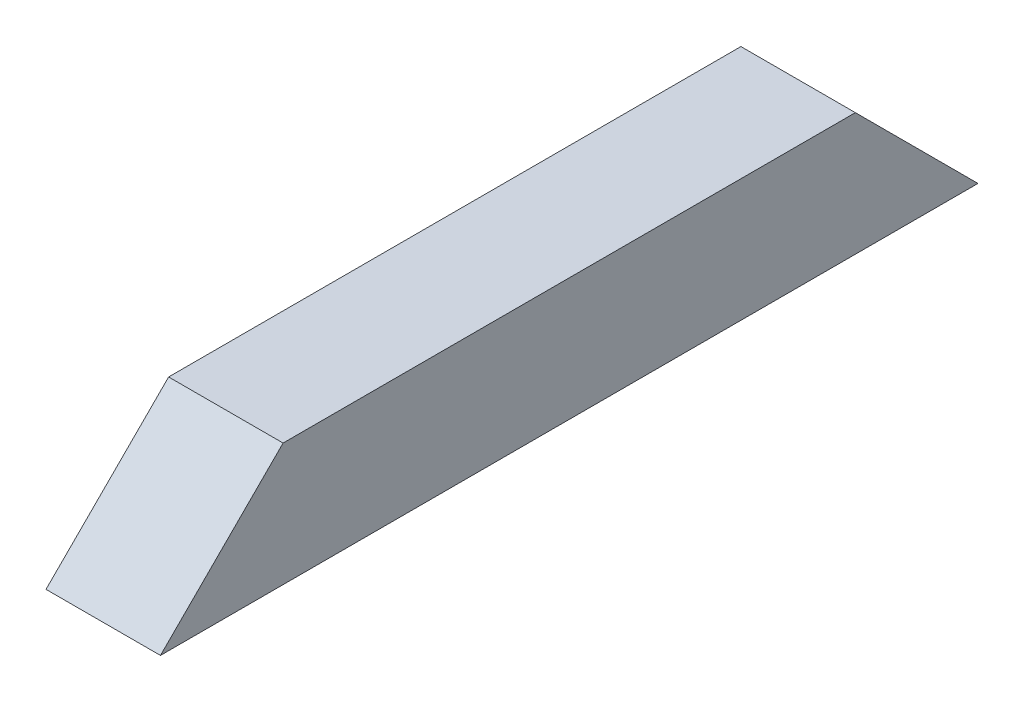
ISO-10303-21;
HEADER;
FILE_DESCRIPTION(('STEP AP214'),'2;1');
FILE_NAME('part.step','',(''),(''),'','','');
FILE_SCHEMA(('AUTOMOTIVE_DESIGN { 1 0 10303 214 1 1 1 1 }'));
ENDSEC;
DATA;
#1=APPLICATION_CONTEXT('core data for automotive mechanical design processes');
#2=APPLICATION_PROTOCOL_DEFINITION('international standard','automotive_design',2000,#1);
#3=PRODUCT_CONTEXT('',#1,'mechanical');
#4=PRODUCT('Part','Part','',(#3));
#5=PRODUCT_RELATED_PRODUCT_CATEGORY('part','',(#4));
#6=PRODUCT_DEFINITION_FORMATION('','',#4);
#7=PRODUCT_DEFINITION_CONTEXT('part definition',#1,'design');
#8=PRODUCT_DEFINITION('design','',#6,#7);
#9=PRODUCT_DEFINITION_SHAPE('','',#8);
#10=(LENGTH_UNIT() NAMED_UNIT(*) SI_UNIT(.MILLI.,.METRE.));
#11=(NAMED_UNIT(*) PLANE_ANGLE_UNIT() SI_UNIT($,.RADIAN.));
#12=(NAMED_UNIT(*) SI_UNIT($,.STERADIAN.) SOLID_ANGLE_UNIT());
#13=UNCERTAINTY_MEASURE_WITH_UNIT(LENGTH_MEASURE(1.E-05),#10,'distance_accuracy_value','');
#14=(GEOMETRIC_REPRESENTATION_CONTEXT(3) GLOBAL_UNCERTAINTY_ASSIGNED_CONTEXT((#13)) GLOBAL_UNIT_ASSIGNED_CONTEXT((#10,
#11,#12)) REPRESENTATION_CONTEXT('',''));
#15=CARTESIAN_POINT('',(0.,0.,0.));
#16=DIRECTION('',(0.,0.,1.));
#17=DIRECTION('',(1.,0.,0.));
#18=AXIS2_PLACEMENT_3D('',#15,#16,#17);
#19=CARTESIAN_POINT('',(0.,9.525,0.));
#20=DIRECTION('',(1.,0.,0.));
#21=DIRECTION('',(0.,0.,-1.));
#22=AXIS2_PLACEMENT_3D('',#19,#20,#21);
#23=PLANE('',#22);
#24=DIRECTION('',(0.,0.,1.));
#25=VECTOR('',#24,1.);
#26=CARTESIAN_POINT('',(0.,9.525,0.));
#27=LINE('',#26,#25);
#28=CARTESIAN_POINT('',(0.,9.525,-53.975));
#29=VERTEX_POINT('',#28);
#30=CARTESIAN_POINT('',(0.,9.525,-9.52499999999997));
#31=VERTEX_POINT('',#30);
#32=EDGE_CURVE('E42',#29,#31,#27,.T.);
#33=ORIENTED_EDGE('',*,*,#32,.F.);
#34=DIRECTION('',(0.,-0.707106781186548,-0.707106781186547));
#35=VECTOR('',#34,1.);
#36=CARTESIAN_POINT('',(0.,31.75,-31.75));
#37=LINE('',#36,#35);
#38=CARTESIAN_POINT('',(0.,0.,-63.5));
#39=VERTEX_POINT('',#38);
#40=EDGE_CURVE('E75',#29,#39,#37,.T.);
#41=ORIENTED_EDGE('',*,*,#40,.T.);
#42=DIRECTION('',(0.,0.,1.));
#43=VECTOR('',#42,1.);
#44=CARTESIAN_POINT('',(0.,0.,0.));
#45=LINE('',#44,#43);
#46=CARTESIAN_POINT('',(0.,0.,0.));
#47=VERTEX_POINT('',#46);
#48=EDGE_CURVE('E97',#39,#47,#45,.T.);
#49=ORIENTED_EDGE('',*,*,#48,.T.);
#50=DIRECTION('',(0.,0.707106781186549,-0.707106781186546));
#51=VECTOR('',#50,1.);
#52=CARTESIAN_POINT('',(0.,0.,0.));
#53=LINE('',#52,#51);
#54=EDGE_CURVE('E58',#47,#31,#53,.T.);
#55=ORIENTED_EDGE('',*,*,#54,.T.);
#56=EDGE_LOOP('',(#33,#41,#49,#55));
#57=FACE_BOUND('',#56,.T.);
#58=ADVANCED_FACE('F34',(#57),#23,.F.);
#59=CARTESIAN_POINT('',(8.89,9.525,0.));
#60=DIRECTION('',(-1.,0.,0.));
#61=DIRECTION('',(0.,0.,1.));
#62=AXIS2_PLACEMENT_3D('',#59,#60,#61);
#63=PLANE('',#62);
#64=DIRECTION('',(0.,0.,-1.));
#65=VECTOR('',#64,1.);
#66=CARTESIAN_POINT('',(8.89,0.,0.));
#67=LINE('',#66,#65);
#68=CARTESIAN_POINT('',(8.89,0.,0.));
#69=VERTEX_POINT('',#68);
#70=CARTESIAN_POINT('',(8.89,0.,-63.5));
#71=VERTEX_POINT('',#70);
#72=EDGE_CURVE('E92',#69,#71,#67,.T.);
#73=ORIENTED_EDGE('',*,*,#72,.T.);
#74=DIRECTION('',(0.,-0.707106781186548,-0.707106781186547));
#75=VECTOR('',#74,1.);
#76=CARTESIAN_POINT('',(8.89,31.75,-31.75));
#77=LINE('',#76,#75);
#78=CARTESIAN_POINT('',(8.89,9.525,-53.975));
#79=VERTEX_POINT('',#78);
#80=EDGE_CURVE('E50',#79,#71,#77,.T.);
#81=ORIENTED_EDGE('',*,*,#80,.F.);
#82=DIRECTION('',(0.,0.,-1.));
#83=VECTOR('',#82,1.);
#84=CARTESIAN_POINT('',(8.89,9.525,0.));
#85=LINE('',#84,#83);
#86=CARTESIAN_POINT('',(8.89,9.525,-9.52499999999997));
#87=VERTEX_POINT('',#86);
#88=EDGE_CURVE('E11',#87,#79,#85,.T.);
#89=ORIENTED_EDGE('',*,*,#88,.F.);
#90=DIRECTION('',(0.,0.707106781186549,-0.707106781186546));
#91=VECTOR('',#90,1.);
#92=CARTESIAN_POINT('',(8.89,0.,0.));
#93=LINE('',#92,#91);
#94=EDGE_CURVE('E89',#69,#87,#93,.T.);
#95=ORIENTED_EDGE('',*,*,#94,.F.);
#96=EDGE_LOOP('',(#73,#81,#89,#95));
#97=FACE_BOUND('',#96,.T.);
#98=ADVANCED_FACE('F103',(#97),#63,.F.);
#99=CARTESIAN_POINT('',(0.,9.525,0.));
#100=DIRECTION('',(0.,-1.,0.));
#101=DIRECTION('',(0.,0.,-1.));
#102=AXIS2_PLACEMENT_3D('',#99,#100,#101);
#103=PLANE('',#102);
#104=ORIENTED_EDGE('',*,*,#88,.T.);
#105=DIRECTION('',(1.,0.,0.));
#106=VECTOR('',#105,1.);
#107=CARTESIAN_POINT('',(0.,9.525,-53.975));
#108=LINE('',#107,#106);
#109=EDGE_CURVE('E78',#29,#79,#108,.T.);
#110=ORIENTED_EDGE('',*,*,#109,.F.);
#111=ORIENTED_EDGE('',*,*,#32,.T.);
#112=DIRECTION('',(1.,0.,0.));
#113=VECTOR('',#112,1.);
#114=CARTESIAN_POINT('',(0.,9.525,-9.52499999999997));
#115=LINE('',#114,#113);
#116=EDGE_CURVE('E94',#31,#87,#115,.T.);
#117=ORIENTED_EDGE('',*,*,#116,.T.);
#118=EDGE_LOOP('',(#104,#110,#111,#117));
#119=FACE_BOUND('',#118,.T.);
#120=ADVANCED_FACE('F86',(#119),#103,.F.);
#121=CARTESIAN_POINT('',(0.,0.,0.));
#122=DIRECTION('',(0.,-1.,0.));
#123=DIRECTION('',(0.,0.,-1.));
#124=AXIS2_PLACEMENT_3D('',#121,#122,#123);
#125=PLANE('',#124);
#126=ORIENTED_EDGE('',*,*,#48,.F.);
#127=DIRECTION('',(-1.,0.,0.));
#128=VECTOR('',#127,1.);
#129=CARTESIAN_POINT('',(0.,0.,-63.5));
#130=LINE('',#129,#128);
#131=EDGE_CURVE('E37',#71,#39,#130,.T.);
#132=ORIENTED_EDGE('',*,*,#131,.F.);
#133=ORIENTED_EDGE('',*,*,#72,.F.);
#134=DIRECTION('',(1.,0.,0.));
#135=VECTOR('',#134,1.);
#136=CARTESIAN_POINT('',(0.,0.,0.));
#137=LINE('',#136,#135);
#138=EDGE_CURVE('E99',#47,#69,#137,.T.);
#139=ORIENTED_EDGE('',*,*,#138,.F.);
#140=EDGE_LOOP('',(#126,#132,#133,#139));
#141=FACE_BOUND('',#140,.T.);
#142=ADVANCED_FACE('F105',(#141),#125,.T.);
#143=CARTESIAN_POINT('',(0.,0.,0.));
#144=DIRECTION('',(0.,-0.707106781186546,-0.707106781186549));
#145=DIRECTION('',(0.,0.707106781186549,-0.707106781186546));
#146=AXIS2_PLACEMENT_3D('',#143,#144,#145);
#147=PLANE('',#146);
#148=ORIENTED_EDGE('',*,*,#94,.T.);
#149=ORIENTED_EDGE('',*,*,#116,.F.);
#150=ORIENTED_EDGE('',*,*,#54,.F.);
#151=ORIENTED_EDGE('',*,*,#138,.T.);
#152=EDGE_LOOP('',(#148,#149,#150,#151));
#153=FACE_BOUND('',#152,.T.);
#154=ADVANCED_FACE('F106',(#153),#147,.F.);
#155=CARTESIAN_POINT('',(0.,31.75,-31.75));
#156=DIRECTION('',(0.,-0.707106781186547,0.707106781186548));
#157=DIRECTION('',(0.,-0.707106781186548,-0.707106781186547));
#158=AXIS2_PLACEMENT_3D('',#155,#156,#157);
#159=PLANE('',#158);
#160=ORIENTED_EDGE('',*,*,#80,.T.);
#161=ORIENTED_EDGE('',*,*,#131,.T.);
#162=ORIENTED_EDGE('',*,*,#40,.F.);
#163=ORIENTED_EDGE('',*,*,#109,.T.);
#164=EDGE_LOOP('',(#160,#161,#162,#163));
#165=FACE_BOUND('',#164,.T.);
#166=ADVANCED_FACE('F77',(#165),#159,.F.);
#167=CLOSED_SHELL('',(#58,#98,#120,#142,#154,#166));
#168=MANIFOLD_SOLID_BREP('B2',#167);
#169=ADVANCED_BREP_SHAPE_REPRESENTATION('',(#18,#168),#14);
#170=SHAPE_DEFINITION_REPRESENTATION(#9,#169);
ENDSEC;
END-ISO-10303-21;
